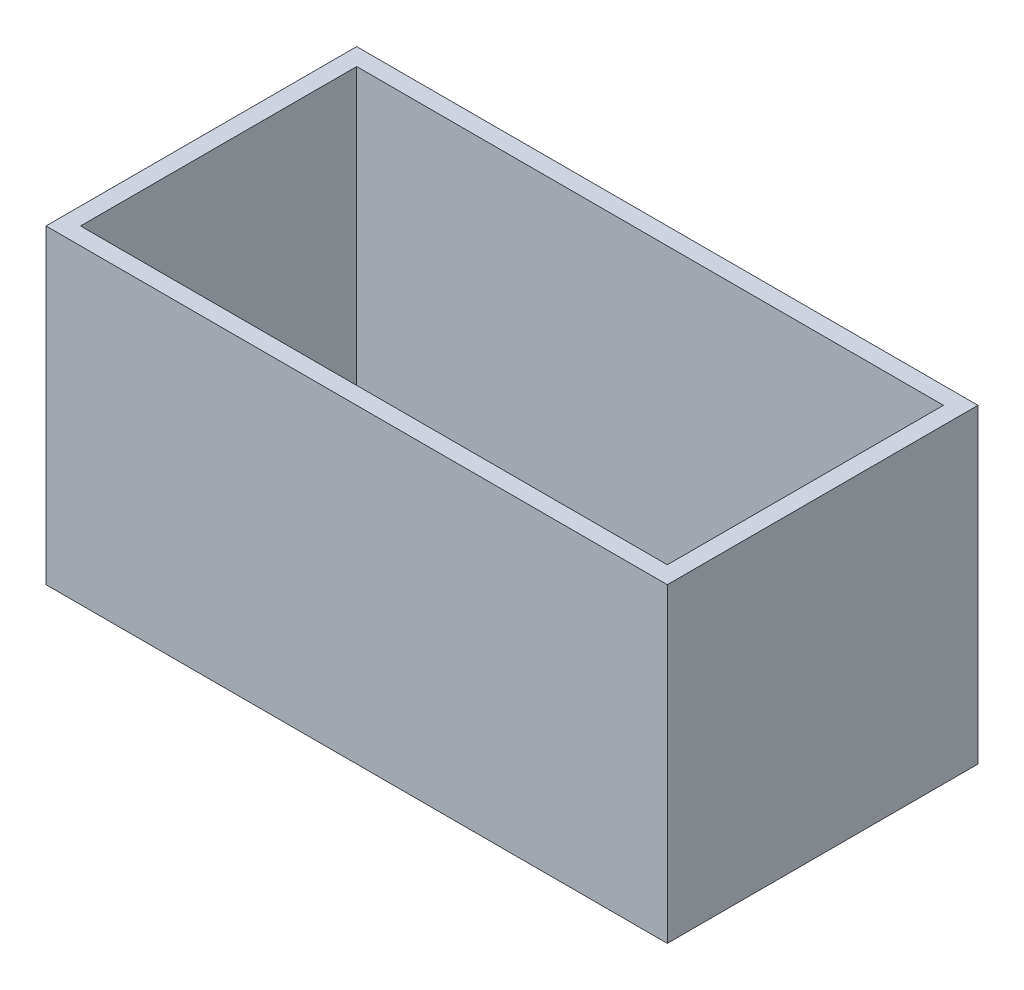
ISO-10303-21;
HEADER;
FILE_DESCRIPTION(('STEP AP214'),'2;1');
FILE_NAME('part.step','',(''),(''),'','','');
FILE_SCHEMA(('AUTOMOTIVE_DESIGN { 1 0 10303 214 1 1 1 1 }'));
ENDSEC;
DATA;
#1=APPLICATION_CONTEXT('core data for automotive mechanical design processes');
#2=APPLICATION_PROTOCOL_DEFINITION('international standard','automotive_design',2000,#1);
#3=PRODUCT_CONTEXT('',#1,'mechanical');
#4=PRODUCT('Part','Part','',(#3));
#5=PRODUCT_RELATED_PRODUCT_CATEGORY('part','',(#4));
#6=PRODUCT_DEFINITION_FORMATION('','',#4);
#7=PRODUCT_DEFINITION_CONTEXT('part definition',#1,'design');
#8=PRODUCT_DEFINITION('design','',#6,#7);
#9=PRODUCT_DEFINITION_SHAPE('','',#8);
#10=(LENGTH_UNIT() NAMED_UNIT(*) SI_UNIT(.MILLI.,.METRE.));
#11=(NAMED_UNIT(*) PLANE_ANGLE_UNIT() SI_UNIT($,.RADIAN.));
#12=(NAMED_UNIT(*) SI_UNIT($,.STERADIAN.) SOLID_ANGLE_UNIT());
#13=UNCERTAINTY_MEASURE_WITH_UNIT(LENGTH_MEASURE(1.E-05),#10,'distance_accuracy_value','');
#14=(GEOMETRIC_REPRESENTATION_CONTEXT(3) GLOBAL_UNCERTAINTY_ASSIGNED_CONTEXT((#13)) GLOBAL_UNIT_ASSIGNED_CONTEXT((#10,
#11,#12)) REPRESENTATION_CONTEXT('',''));
#15=CARTESIAN_POINT('',(0.,0.,0.));
#16=DIRECTION('',(0.,0.,1.));
#17=DIRECTION('',(1.,0.,0.));
#18=AXIS2_PLACEMENT_3D('',#15,#16,#17);
#19=CARTESIAN_POINT('',(0.,18.,0.));
#20=DIRECTION('',(0.,-1.,0.));
#21=DIRECTION('',(0.,0.,-1.));
#22=AXIS2_PLACEMENT_3D('',#19,#20,#21);
#23=PLANE('',#22);
#24=DIRECTION('',(0.,0.,-1.));
#25=VECTOR('',#24,1.);
#26=CARTESIAN_POINT('',(18.,18.,9.));
#27=LINE('',#26,#25);
#28=CARTESIAN_POINT('',(18.,18.,9.));
#29=VERTEX_POINT('',#28);
#30=CARTESIAN_POINT('',(18.,18.,-9.));
#31=VERTEX_POINT('',#30);
#32=EDGE_CURVE('E157',#29,#31,#27,.T.);
#33=ORIENTED_EDGE('',*,*,#32,.T.);
#34=DIRECTION('',(-1.,0.,0.));
#35=VECTOR('',#34,1.);
#36=CARTESIAN_POINT('',(-18.,18.,-9.));
#37=LINE('',#36,#35);
#38=CARTESIAN_POINT('',(-18.,18.,-9.));
#39=VERTEX_POINT('',#38);
#40=EDGE_CURVE('E92',#31,#39,#37,.T.);
#41=ORIENTED_EDGE('',*,*,#40,.T.);
#42=DIRECTION('',(0.,0.,1.));
#43=VECTOR('',#42,1.);
#44=CARTESIAN_POINT('',(-18.,18.,9.));
#45=LINE('',#44,#43);
#46=CARTESIAN_POINT('',(-18.,18.,9.));
#47=VERTEX_POINT('',#46);
#48=EDGE_CURVE('E162',#39,#47,#45,.T.);
#49=ORIENTED_EDGE('',*,*,#48,.T.);
#50=DIRECTION('',(1.,0.,0.));
#51=VECTOR('',#50,1.);
#52=CARTESIAN_POINT('',(-18.,18.,9.));
#53=LINE('',#52,#51);
#54=EDGE_CURVE('E64',#47,#29,#53,.T.);
#55=ORIENTED_EDGE('',*,*,#54,.T.);
#56=EDGE_LOOP('',(#33,#41,#49,#55));
#57=FACE_BOUND('',#56,.T.);
#58=DIRECTION('',(0.,0.,-1.));
#59=VECTOR('',#58,1.);
#60=CARTESIAN_POINT('',(17.,18.,0.));
#61=LINE('',#60,#59);
#62=CARTESIAN_POINT('',(17.,18.,8.));
#63=VERTEX_POINT('',#62);
#64=CARTESIAN_POINT('',(17.,18.,-8.));
#65=VERTEX_POINT('',#64);
#66=EDGE_CURVE('E141',#63,#65,#61,.T.);
#67=ORIENTED_EDGE('',*,*,#66,.F.);
#68=DIRECTION('',(1.,0.,0.));
#69=VECTOR('',#68,1.);
#70=CARTESIAN_POINT('',(0.,18.,8.));
#71=LINE('',#70,#69);
#72=CARTESIAN_POINT('',(-17.,18.,8.));
#73=VERTEX_POINT('',#72);
#74=EDGE_CURVE('E154',#73,#63,#71,.T.);
#75=ORIENTED_EDGE('',*,*,#74,.F.);
#76=DIRECTION('',(0.,0.,1.));
#77=VECTOR('',#76,1.);
#78=CARTESIAN_POINT('',(-17.,18.,0.));
#79=LINE('',#78,#77);
#80=CARTESIAN_POINT('',(-17.,18.,-8.));
#81=VERTEX_POINT('',#80);
#82=EDGE_CURVE('E151',#81,#73,#79,.T.);
#83=ORIENTED_EDGE('',*,*,#82,.F.);
#84=DIRECTION('',(-1.,0.,0.));
#85=VECTOR('',#84,1.);
#86=CARTESIAN_POINT('',(0.,18.,-8.));
#87=LINE('',#86,#85);
#88=EDGE_CURVE('E130',#65,#81,#87,.T.);
#89=ORIENTED_EDGE('',*,*,#88,.F.);
#90=EDGE_LOOP('',(#67,#75,#83,#89));
#91=FACE_BOUND('',#90,.T.);
#92=ADVANCED_FACE('F39',(#57,#91),#23,.F.);
#93=CARTESIAN_POINT('',(18.,18.,9.));
#94=DIRECTION('',(-1.,0.,0.));
#95=DIRECTION('',(0.,0.,1.));
#96=AXIS2_PLACEMENT_3D('',#93,#94,#95);
#97=PLANE('',#96);
#98=DIRECTION('',(0.,0.,-1.));
#99=VECTOR('',#98,1.);
#100=CARTESIAN_POINT('',(18.,0.,9.));
#101=LINE('',#100,#99);
#102=CARTESIAN_POINT('',(18.,0.,9.));
#103=VERTEX_POINT('',#102);
#104=CARTESIAN_POINT('',(18.,0.,-9.));
#105=VERTEX_POINT('',#104);
#106=EDGE_CURVE('E168',#103,#105,#101,.T.);
#107=ORIENTED_EDGE('',*,*,#106,.T.);
#108=DIRECTION('',(0.,-1.,0.));
#109=VECTOR('',#108,1.);
#110=CARTESIAN_POINT('',(18.,18.,-9.));
#111=LINE('',#110,#109);
#112=EDGE_CURVE('E11',#31,#105,#111,.T.);
#113=ORIENTED_EDGE('',*,*,#112,.F.);
#114=ORIENTED_EDGE('',*,*,#32,.F.);
#115=DIRECTION('',(0.,-1.,0.));
#116=VECTOR('',#115,1.);
#117=CARTESIAN_POINT('',(18.,18.,9.));
#118=LINE('',#117,#116);
#119=EDGE_CURVE('E167',#29,#103,#118,.T.);
#120=ORIENTED_EDGE('',*,*,#119,.T.);
#121=EDGE_LOOP('',(#107,#113,#114,#120));
#122=FACE_BOUND('',#121,.T.);
#123=ADVANCED_FACE('F41',(#122),#97,.F.);
#124=CARTESIAN_POINT('',(-18.,18.,-9.));
#125=DIRECTION('',(0.,0.,1.));
#126=DIRECTION('',(1.,0.,0.));
#127=AXIS2_PLACEMENT_3D('',#124,#125,#126);
#128=PLANE('',#127);
#129=DIRECTION('',(-1.,0.,0.));
#130=VECTOR('',#129,1.);
#131=CARTESIAN_POINT('',(-18.,0.,-9.));
#132=LINE('',#131,#130);
#133=CARTESIAN_POINT('',(-18.,0.,-9.));
#134=VERTEX_POINT('',#133);
#135=EDGE_CURVE('E172',#105,#134,#132,.T.);
#136=ORIENTED_EDGE('',*,*,#135,.T.);
#137=DIRECTION('',(0.,-1.,0.));
#138=VECTOR('',#137,1.);
#139=CARTESIAN_POINT('',(-18.,18.,-9.));
#140=LINE('',#139,#138);
#141=EDGE_CURVE('E48',#39,#134,#140,.T.);
#142=ORIENTED_EDGE('',*,*,#141,.F.);
#143=ORIENTED_EDGE('',*,*,#40,.F.);
#144=ORIENTED_EDGE('',*,*,#112,.T.);
#145=EDGE_LOOP('',(#136,#142,#143,#144));
#146=FACE_BOUND('',#145,.T.);
#147=ADVANCED_FACE('F206',(#146),#128,.F.);
#148=CARTESIAN_POINT('',(-18.,18.,9.));
#149=DIRECTION('',(1.,0.,0.));
#150=DIRECTION('',(0.,0.,-1.));
#151=AXIS2_PLACEMENT_3D('',#148,#149,#150);
#152=PLANE('',#151);
#153=DIRECTION('',(0.,0.,1.));
#154=VECTOR('',#153,1.);
#155=CARTESIAN_POINT('',(-18.,0.,9.));
#156=LINE('',#155,#154);
#157=CARTESIAN_POINT('',(-18.,0.,9.));
#158=VERTEX_POINT('',#157);
#159=EDGE_CURVE('E175',#134,#158,#156,.T.);
#160=ORIENTED_EDGE('',*,*,#159,.T.);
#161=DIRECTION('',(0.,-1.,0.));
#162=VECTOR('',#161,1.);
#163=CARTESIAN_POINT('',(-18.,18.,9.));
#164=LINE('',#163,#162);
#165=EDGE_CURVE('E182',#47,#158,#164,.T.);
#166=ORIENTED_EDGE('',*,*,#165,.F.);
#167=ORIENTED_EDGE('',*,*,#48,.F.);
#168=ORIENTED_EDGE('',*,*,#141,.T.);
#169=EDGE_LOOP('',(#160,#166,#167,#168));
#170=FACE_BOUND('',#169,.T.);
#171=ADVANCED_FACE('F189',(#170),#152,.F.);
#172=CARTESIAN_POINT('',(-18.,18.,9.));
#173=DIRECTION('',(0.,0.,-1.));
#174=DIRECTION('',(-1.,0.,0.));
#175=AXIS2_PLACEMENT_3D('',#172,#173,#174);
#176=PLANE('',#175);
#177=DIRECTION('',(1.,0.,0.));
#178=VECTOR('',#177,1.);
#179=CARTESIAN_POINT('',(-18.,0.,9.));
#180=LINE('',#179,#178);
#181=EDGE_CURVE('E85',#158,#103,#180,.T.);
#182=ORIENTED_EDGE('',*,*,#181,.T.);
#183=ORIENTED_EDGE('',*,*,#119,.F.);
#184=ORIENTED_EDGE('',*,*,#54,.F.);
#185=ORIENTED_EDGE('',*,*,#165,.T.);
#186=EDGE_LOOP('',(#182,#183,#184,#185));
#187=FACE_BOUND('',#186,.T.);
#188=ADVANCED_FACE('F197',(#187),#176,.F.);
#189=CARTESIAN_POINT('',(0.,0.,0.));
#190=DIRECTION('',(0.,-1.,0.));
#191=DIRECTION('',(0.,0.,-1.));
#192=AXIS2_PLACEMENT_3D('',#189,#190,#191);
#193=PLANE('',#192);
#194=ORIENTED_EDGE('',*,*,#106,.F.);
#195=ORIENTED_EDGE('',*,*,#181,.F.);
#196=ORIENTED_EDGE('',*,*,#159,.F.);
#197=ORIENTED_EDGE('',*,*,#135,.F.);
#198=EDGE_LOOP('',(#194,#195,#196,#197));
#199=FACE_BOUND('',#198,.T.);
#200=ADVANCED_FACE('F193',(#199),#193,.T.);
#201=CARTESIAN_POINT('',(17.,18.,9.));
#202=DIRECTION('',(-1.,0.,0.));
#203=DIRECTION('',(0.,0.,1.));
#204=AXIS2_PLACEMENT_3D('',#201,#202,#203);
#205=PLANE('',#204);
#206=DIRECTION('',(0.,0.,-1.));
#207=VECTOR('',#206,1.);
#208=CARTESIAN_POINT('',(17.,1.,0.));
#209=LINE('',#208,#207);
#210=CARTESIAN_POINT('',(17.,1.,8.));
#211=VERTEX_POINT('',#210);
#212=CARTESIAN_POINT('',(17.,1.,-8.));
#213=VERTEX_POINT('',#212);
#214=EDGE_CURVE('E120',#211,#213,#209,.T.);
#215=ORIENTED_EDGE('',*,*,#214,.F.);
#216=DIRECTION('',(0.,-1.,0.));
#217=VECTOR('',#216,1.);
#218=CARTESIAN_POINT('',(17.,18.,8.));
#219=LINE('',#218,#217);
#220=EDGE_CURVE('E145',#63,#211,#219,.T.);
#221=ORIENTED_EDGE('',*,*,#220,.F.);
#222=ORIENTED_EDGE('',*,*,#66,.T.);
#223=DIRECTION('',(0.,-1.,0.));
#224=VECTOR('',#223,1.);
#225=CARTESIAN_POINT('',(17.,18.,-8.));
#226=LINE('',#225,#224);
#227=EDGE_CURVE('E134',#65,#213,#226,.T.);
#228=ORIENTED_EDGE('',*,*,#227,.T.);
#229=EDGE_LOOP('',(#215,#221,#222,#228));
#230=FACE_BOUND('',#229,.T.);
#231=ADVANCED_FACE('F204',(#230),#205,.T.);
#232=CARTESIAN_POINT('',(-18.,18.,-8.));
#233=DIRECTION('',(0.,0.,1.));
#234=DIRECTION('',(1.,0.,0.));
#235=AXIS2_PLACEMENT_3D('',#232,#233,#234);
#236=PLANE('',#235);
#237=DIRECTION('',(-1.,0.,0.));
#238=VECTOR('',#237,1.);
#239=CARTESIAN_POINT('',(0.,1.,-8.));
#240=LINE('',#239,#238);
#241=CARTESIAN_POINT('',(-17.,1.,-8.));
#242=VERTEX_POINT('',#241);
#243=EDGE_CURVE('E114',#213,#242,#240,.T.);
#244=ORIENTED_EDGE('',*,*,#243,.F.);
#245=ORIENTED_EDGE('',*,*,#227,.F.);
#246=ORIENTED_EDGE('',*,*,#88,.T.);
#247=DIRECTION('',(0.,-1.,0.));
#248=VECTOR('',#247,1.);
#249=CARTESIAN_POINT('',(-17.,18.,-8.));
#250=LINE('',#249,#248);
#251=EDGE_CURVE('E127',#81,#242,#250,.T.);
#252=ORIENTED_EDGE('',*,*,#251,.T.);
#253=EDGE_LOOP('',(#244,#245,#246,#252));
#254=FACE_BOUND('',#253,.T.);
#255=ADVANCED_FACE('F128',(#254),#236,.T.);
#256=CARTESIAN_POINT('',(-17.,18.,9.));
#257=DIRECTION('',(1.,0.,0.));
#258=DIRECTION('',(0.,0.,-1.));
#259=AXIS2_PLACEMENT_3D('',#256,#257,#258);
#260=PLANE('',#259);
#261=DIRECTION('',(0.,0.,1.));
#262=VECTOR('',#261,1.);
#263=CARTESIAN_POINT('',(-17.,1.,0.));
#264=LINE('',#263,#262);
#265=CARTESIAN_POINT('',(-17.,1.,8.));
#266=VERTEX_POINT('',#265);
#267=EDGE_CURVE('E118',#242,#266,#264,.T.);
#268=ORIENTED_EDGE('',*,*,#267,.F.);
#269=ORIENTED_EDGE('',*,*,#251,.F.);
#270=ORIENTED_EDGE('',*,*,#82,.T.);
#271=DIRECTION('',(0.,-1.,0.));
#272=VECTOR('',#271,1.);
#273=CARTESIAN_POINT('',(-17.,18.,8.));
#274=LINE('',#273,#272);
#275=EDGE_CURVE('E55',#73,#266,#274,.T.);
#276=ORIENTED_EDGE('',*,*,#275,.T.);
#277=EDGE_LOOP('',(#268,#269,#270,#276));
#278=FACE_BOUND('',#277,.T.);
#279=ADVANCED_FACE('F136',(#278),#260,.T.);
#280=CARTESIAN_POINT('',(-18.,18.,8.));
#281=DIRECTION('',(0.,0.,-1.));
#282=DIRECTION('',(-1.,0.,0.));
#283=AXIS2_PLACEMENT_3D('',#280,#281,#282);
#284=PLANE('',#283);
#285=DIRECTION('',(1.,0.,0.));
#286=VECTOR('',#285,1.);
#287=CARTESIAN_POINT('',(0.,1.,8.));
#288=LINE('',#287,#286);
#289=EDGE_CURVE('E138',#266,#211,#288,.T.);
#290=ORIENTED_EDGE('',*,*,#289,.F.);
#291=ORIENTED_EDGE('',*,*,#275,.F.);
#292=ORIENTED_EDGE('',*,*,#74,.T.);
#293=ORIENTED_EDGE('',*,*,#220,.T.);
#294=EDGE_LOOP('',(#290,#291,#292,#293));
#295=FACE_BOUND('',#294,.T.);
#296=ADVANCED_FACE('F217',(#295),#284,.T.);
#297=CARTESIAN_POINT('',(0.,1.,0.));
#298=DIRECTION('',(0.,-1.,0.));
#299=DIRECTION('',(0.,0.,-1.));
#300=AXIS2_PLACEMENT_3D('',#297,#298,#299);
#301=PLANE('',#300);
#302=ORIENTED_EDGE('',*,*,#214,.T.);
#303=ORIENTED_EDGE('',*,*,#243,.T.);
#304=ORIENTED_EDGE('',*,*,#267,.T.);
#305=ORIENTED_EDGE('',*,*,#289,.T.);
#306=EDGE_LOOP('',(#302,#303,#304,#305));
#307=FACE_BOUND('',#306,.T.);
#308=ADVANCED_FACE('F116',(#307),#301,.F.);
#309=CLOSED_SHELL('',(#92,#123,#147,#171,#188,#200,#231,#255,#279,#296,#308));
#310=MANIFOLD_SOLID_BREP('B2',#309);
#311=ADVANCED_BREP_SHAPE_REPRESENTATION('',(#18,#310),#14);
#312=SHAPE_DEFINITION_REPRESENTATION(#9,#311);
ENDSEC;
END-ISO-10303-21;
